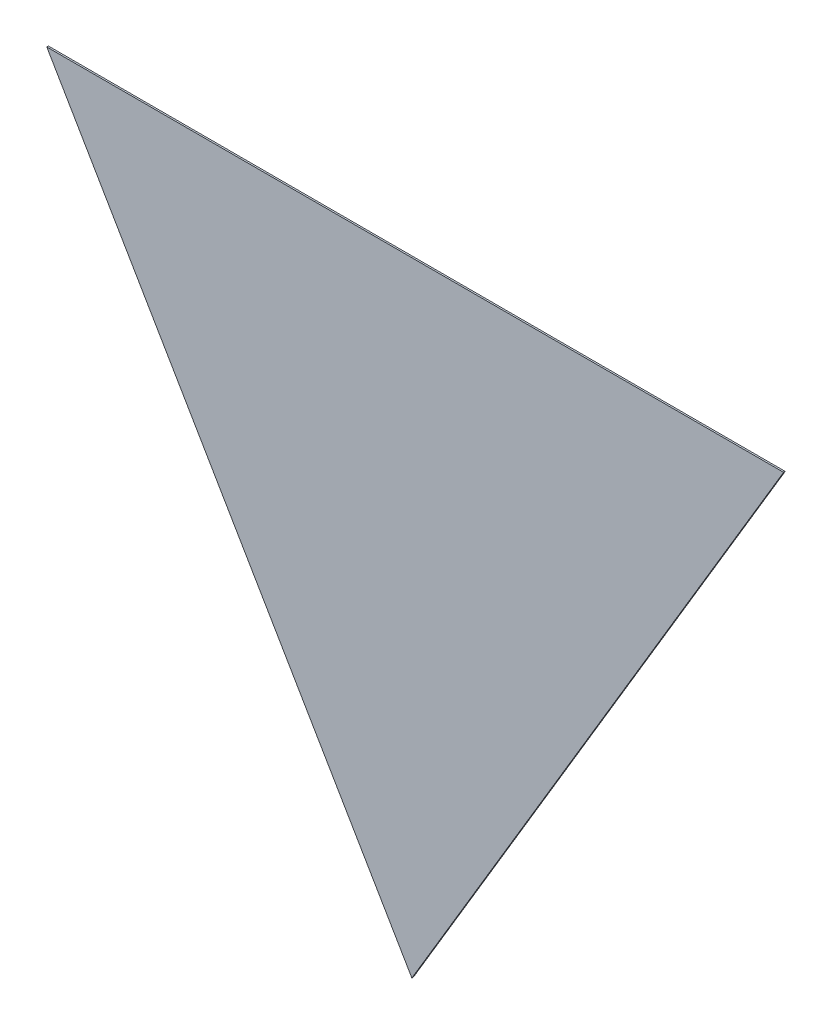
ISO-10303-21;
HEADER;
FILE_DESCRIPTION(('STEP AP214'),'2;1');
FILE_NAME('part.step','',(''),(''),'','','');
FILE_SCHEMA(('AUTOMOTIVE_DESIGN { 1 0 10303 214 1 1 1 1 }'));
ENDSEC;
DATA;
#1=APPLICATION_CONTEXT('core data for automotive mechanical design processes');
#2=APPLICATION_PROTOCOL_DEFINITION('international standard','automotive_design',2000,#1);
#3=PRODUCT_CONTEXT('',#1,'mechanical');
#4=PRODUCT('Part','Part','',(#3));
#5=PRODUCT_RELATED_PRODUCT_CATEGORY('part','',(#4));
#6=PRODUCT_DEFINITION_FORMATION('','',#4);
#7=PRODUCT_DEFINITION_CONTEXT('part definition',#1,'design');
#8=PRODUCT_DEFINITION('design','',#6,#7);
#9=PRODUCT_DEFINITION_SHAPE('','',#8);
#10=(LENGTH_UNIT() NAMED_UNIT(*) SI_UNIT(.MILLI.,.METRE.));
#11=(NAMED_UNIT(*) PLANE_ANGLE_UNIT() SI_UNIT($,.RADIAN.));
#12=(NAMED_UNIT(*) SI_UNIT($,.STERADIAN.) SOLID_ANGLE_UNIT());
#13=UNCERTAINTY_MEASURE_WITH_UNIT(LENGTH_MEASURE(1.E-05),#10,'distance_accuracy_value','');
#14=(GEOMETRIC_REPRESENTATION_CONTEXT(3) GLOBAL_UNCERTAINTY_ASSIGNED_CONTEXT((#13)) GLOBAL_UNIT_ASSIGNED_CONTEXT((#10,
#11,#12)) REPRESENTATION_CONTEXT('',''));
#15=CARTESIAN_POINT('',(0.,0.,0.));
#16=DIRECTION('',(0.,0.,1.));
#17=DIRECTION('',(1.,0.,0.));
#18=AXIS2_PLACEMENT_3D('',#15,#16,#17);
#19=CARTESIAN_POINT('',(0.00453999972601257,0.676471348607,0.00045));
#20=DIRECTION('',(0.859023340627718,-0.511936422084614,0.));
#21=DIRECTION('',(0.,0.,-1.));
#22=AXIS2_PLACEMENT_3D('',#19,#20,#21);
#23=PLANE('',#22);
#24=DIRECTION('',(0.,2.46716227694479E-13,1.));
#25=VECTOR('',#24,1.);
#26=CARTESIAN_POINT('',(0.0554434698010498,0.76188677721695,0.));
#27=LINE('',#26,#25);
#28=CARTESIAN_POINT('',(0.0554434698010498,0.76188677721695,0.));
#29=VERTEX_POINT('',#28);
#30=CARTESIAN_POINT('',(0.0554434698010498,0.76188677721695,0.00045));
#31=VERTEX_POINT('',#30);
#32=EDGE_CURVE('E11',#29,#31,#27,.T.);
#33=ORIENTED_EDGE('',*,*,#32,.T.);
#34=DIRECTION('',(-0.511936422084614,-0.859023340627718,0.));
#35=VECTOR('',#34,1.);
#36=CARTESIAN_POINT('',(0.0554434698010498,0.76188677721695,0.00045));
#37=LINE('',#36,#35);
#38=CARTESIAN_POINT('',(-0.0463634703490247,0.59105591999705,0.00045));
#39=VERTEX_POINT('',#38);
#40=EDGE_CURVE('E69',#31,#39,#37,.T.);
#41=ORIENTED_EDGE('',*,*,#40,.T.);
#42=DIRECTION('',(0.,0.,1.));
#43=VECTOR('',#42,1.);
#44=CARTESIAN_POINT('',(-0.0463634703490247,0.59105591999705,0.));
#45=LINE('',#44,#43);
#46=CARTESIAN_POINT('',(-0.0463634703490247,0.59105591999705,0.));
#47=VERTEX_POINT('',#46);
#48=EDGE_CURVE('E24',#47,#39,#45,.T.);
#49=ORIENTED_EDGE('',*,*,#48,.F.);
#50=DIRECTION('',(-0.511936422084614,-0.859023340627718,0.));
#51=VECTOR('',#50,1.);
#52=CARTESIAN_POINT('',(0.0554434698010498,0.76188677721695,0.));
#53=LINE('',#52,#51);
#54=EDGE_CURVE('E47',#29,#47,#53,.T.);
#55=ORIENTED_EDGE('',*,*,#54,.F.);
#56=EDGE_LOOP('',(#33,#41,#49,#55));
#57=FACE_BOUND('',#56,.T.);
#58=ADVANCED_FACE('F17',(#57),#23,.T.);
#59=CARTESIAN_POINT('',(-0.0963526928240124,0.676471348607,0.00045));
#60=DIRECTION('',(-0.863058750862992,-0.505103546373229,0.));
#61=DIRECTION('',(0.,0.,1.));
#62=AXIS2_PLACEMENT_3D('',#59,#60,#61);
#63=PLANE('',#62);
#64=ORIENTED_EDGE('',*,*,#48,.T.);
#65=DIRECTION('',(-0.505103546373229,0.863058750862991,0.));
#66=VECTOR('',#65,1.);
#67=CARTESIAN_POINT('',(-0.0463634703490247,0.59105591999705,0.00045));
#68=LINE('',#67,#66);
#69=CARTESIAN_POINT('',(-0.146341915299,0.76188677721695,0.00045));
#70=VERTEX_POINT('',#69);
#71=EDGE_CURVE('E51',#39,#70,#68,.T.);
#72=ORIENTED_EDGE('',*,*,#71,.T.);
#73=DIRECTION('',(0.,2.46716227694479E-13,1.));
#74=VECTOR('',#73,1.);
#75=CARTESIAN_POINT('',(-0.146341915299,0.76188677721695,0.));
#76=LINE('',#75,#74);
#77=CARTESIAN_POINT('',(-0.146341915299,0.76188677721695,0.));
#78=VERTEX_POINT('',#77);
#79=EDGE_CURVE('E67',#78,#70,#76,.T.);
#80=ORIENTED_EDGE('',*,*,#79,.F.);
#81=DIRECTION('',(-0.505103546373229,0.863058750862991,0.));
#82=VECTOR('',#81,1.);
#83=CARTESIAN_POINT('',(-0.0463634703490247,0.59105591999705,0.));
#84=LINE('',#83,#82);
#85=EDGE_CURVE('E61',#47,#78,#84,.T.);
#86=ORIENTED_EDGE('',*,*,#85,.F.);
#87=EDGE_LOOP('',(#64,#72,#80,#86));
#88=FACE_BOUND('',#87,.T.);
#89=ADVANCED_FACE('F73',(#88),#63,.T.);
#90=CARTESIAN_POINT('',(-0.0454492227489752,0.76188677721695,0.00045));
#91=DIRECTION('',(0.,1.,0.));
#92=DIRECTION('',(0.,0.,1.));
#93=AXIS2_PLACEMENT_3D('',#90,#91,#92);
#94=PLANE('',#93);
#95=ORIENTED_EDGE('',*,*,#79,.T.);
#96=DIRECTION('',(1.,0.,0.));
#97=VECTOR('',#96,1.);
#98=CARTESIAN_POINT('',(-0.146341915299,0.76188677721695,0.00045));
#99=LINE('',#98,#97);
#100=EDGE_CURVE('E52',#70,#31,#99,.T.);
#101=ORIENTED_EDGE('',*,*,#100,.T.);
#102=ORIENTED_EDGE('',*,*,#32,.F.);
#103=DIRECTION('',(1.,0.,0.));
#104=VECTOR('',#103,1.);
#105=CARTESIAN_POINT('',(-0.146341915299,0.76188677721695,0.));
#106=LINE('',#105,#104);
#107=EDGE_CURVE('E57',#78,#29,#106,.T.);
#108=ORIENTED_EDGE('',*,*,#107,.F.);
#109=EDGE_LOOP('',(#95,#101,#102,#108));
#110=FACE_BOUND('',#109,.T.);
#111=ADVANCED_FACE('F56',(#110),#94,.T.);
#112=CARTESIAN_POINT('',(-0.0454492227489752,0.59105591999705,0.));
#113=DIRECTION('',(0.,0.,1.));
#114=DIRECTION('',(1.,0.,0.));
#115=AXIS2_PLACEMENT_3D('',#112,#113,#114);
#116=PLANE('',#115);
#117=ORIENTED_EDGE('',*,*,#54,.T.);
#118=ORIENTED_EDGE('',*,*,#85,.T.);
#119=ORIENTED_EDGE('',*,*,#107,.T.);
#120=EDGE_LOOP('',(#117,#118,#119));
#121=FACE_BOUND('',#120,.T.);
#122=ADVANCED_FACE('F60',(#121),#116,.F.);
#123=CARTESIAN_POINT('',(-0.0454492227489752,0.59105591999705,0.00045));
#124=DIRECTION('',(0.,0.,1.));
#125=DIRECTION('',(1.,0.,0.));
#126=AXIS2_PLACEMENT_3D('',#123,#124,#125);
#127=PLANE('',#126);
#128=ORIENTED_EDGE('',*,*,#40,.F.);
#129=ORIENTED_EDGE('',*,*,#100,.F.);
#130=ORIENTED_EDGE('',*,*,#71,.F.);
#131=EDGE_LOOP('',(#128,#129,#130));
#132=FACE_BOUND('',#131,.T.);
#133=ADVANCED_FACE('F72',(#132),#127,.T.);
#134=CLOSED_SHELL('',(#58,#89,#111,#122,#133));
#135=MANIFOLD_SOLID_BREP('B1',#134);
#136=ADVANCED_BREP_SHAPE_REPRESENTATION('',(#18,#135),#14);
#137=SHAPE_DEFINITION_REPRESENTATION(#9,#136);
ENDSEC;
END-ISO-10303-21;
